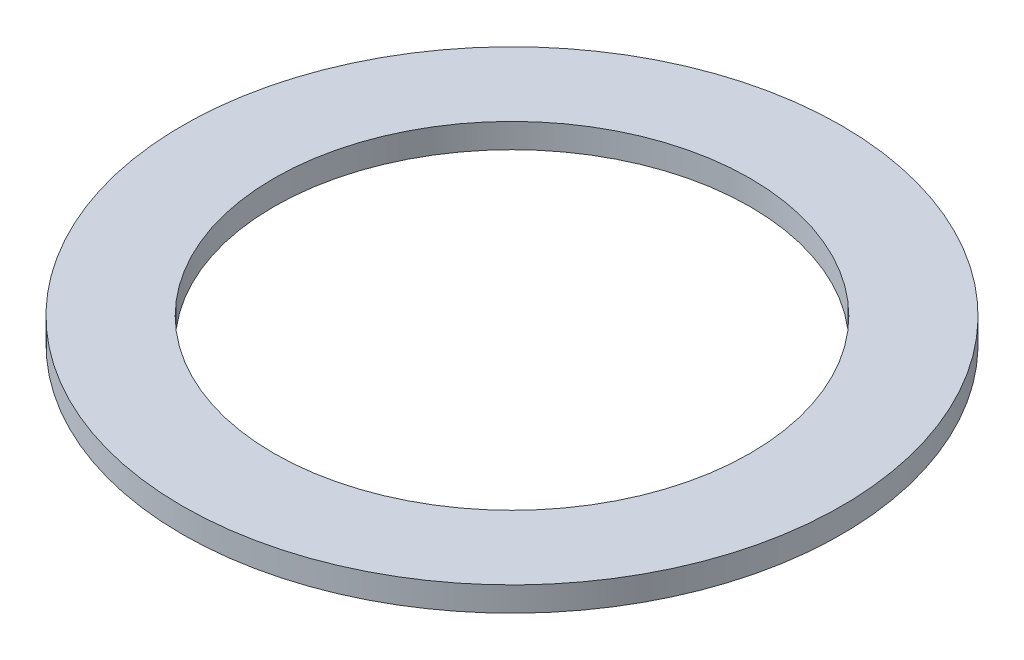
ISO-10303-21;
HEADER;
FILE_DESCRIPTION(('STEP AP214'),'2;1');
FILE_NAME('part.step','',(''),(''),'','','');
FILE_SCHEMA(('AUTOMOTIVE_DESIGN { 1 0 10303 214 1 1 1 1 }'));
ENDSEC;
DATA;
#1=APPLICATION_CONTEXT('core data for automotive mechanical design processes');
#2=APPLICATION_PROTOCOL_DEFINITION('international standard','automotive_design',2000,#1);
#3=PRODUCT_CONTEXT('',#1,'mechanical');
#4=PRODUCT('Part','Part','',(#3));
#5=PRODUCT_RELATED_PRODUCT_CATEGORY('part','',(#4));
#6=PRODUCT_DEFINITION_FORMATION('','',#4);
#7=PRODUCT_DEFINITION_CONTEXT('part definition',#1,'design');
#8=PRODUCT_DEFINITION('design','',#6,#7);
#9=PRODUCT_DEFINITION_SHAPE('','',#8);
#10=(LENGTH_UNIT() NAMED_UNIT(*) SI_UNIT(.MILLI.,.METRE.));
#11=(NAMED_UNIT(*) PLANE_ANGLE_UNIT() SI_UNIT($,.RADIAN.));
#12=(NAMED_UNIT(*) SI_UNIT($,.STERADIAN.) SOLID_ANGLE_UNIT());
#13=UNCERTAINTY_MEASURE_WITH_UNIT(LENGTH_MEASURE(1.E-05),#10,'distance_accuracy_value','');
#14=(GEOMETRIC_REPRESENTATION_CONTEXT(3) GLOBAL_UNCERTAINTY_ASSIGNED_CONTEXT((#13)) GLOBAL_UNIT_ASSIGNED_CONTEXT((#10,
#11,#12)) REPRESENTATION_CONTEXT('',''));
#15=CARTESIAN_POINT('',(0.,0.,0.));
#16=DIRECTION('',(0.,0.,1.));
#17=DIRECTION('',(1.,0.,0.));
#18=AXIS2_PLACEMENT_3D('',#15,#16,#17);
#19=CARTESIAN_POINT('',(0.,0.195231468618644,0.));
#20=DIRECTION('',(0.,-1.,0.));
#21=DIRECTION('',(0.,0.,-1.));
#22=AXIS2_PLACEMENT_3D('',#19,#20,#21);
#23=CYLINDRICAL_SURFACE('',#22,19.4945);
#24=CARTESIAN_POINT('',(0.,0.,0.));
#25=DIRECTION('',(0.,-1.,0.));
#26=DIRECTION('',(0.,0.,-1.));
#27=AXIS2_PLACEMENT_3D('',#24,#25,#26);
#28=CIRCLE('',#27,19.4945);
#29=CARTESIAN_POINT('',(0.,0.,-19.4945));
#30=VERTEX_POINT('',#29);
#31=EDGE_CURVE('E10',#30,#30,#28,.T.);
#32=ORIENTED_EDGE('',*,*,#31,.T.);
#33=EDGE_LOOP('',(#32));
#34=FACE_BOUND('',#33,.T.);
#35=CARTESIAN_POINT('',(0.,2.0066,0.));
#36=DIRECTION('',(0.,-1.,0.));
#37=DIRECTION('',(0.,0.,-1.));
#38=AXIS2_PLACEMENT_3D('',#35,#36,#37);
#39=CIRCLE('',#38,19.4945);
#40=CARTESIAN_POINT('',(0.,2.0066,-19.4945));
#41=VERTEX_POINT('',#40);
#42=EDGE_CURVE('E50',#41,#41,#39,.T.);
#43=ORIENTED_EDGE('',*,*,#42,.F.);
#44=EDGE_LOOP('',(#43));
#45=FACE_BOUND('',#44,.T.);
#46=ADVANCED_FACE('F36',(#34,#45),#23,.F.);
#47=CARTESIAN_POINT('',(19.4945,0.,0.));
#48=DIRECTION('',(0.,-1.,0.));
#49=DIRECTION('',(0.,0.,-1.));
#50=AXIS2_PLACEMENT_3D('',#47,#48,#49);
#51=PLANE('',#50);
#52=CARTESIAN_POINT('',(0.,0.,0.));
#53=DIRECTION('',(0.,-1.,0.));
#54=DIRECTION('',(0.,0.,-1.));
#55=AXIS2_PLACEMENT_3D('',#52,#53,#54);
#56=CIRCLE('',#55,26.9748);
#57=CARTESIAN_POINT('',(0.,0.,-26.9748));
#58=VERTEX_POINT('',#57);
#59=EDGE_CURVE('E42',#58,#58,#56,.T.);
#60=ORIENTED_EDGE('',*,*,#59,.T.);
#61=EDGE_LOOP('',(#60));
#62=FACE_BOUND('',#61,.T.);
#63=ORIENTED_EDGE('',*,*,#31,.F.);
#64=EDGE_LOOP('',(#63));
#65=FACE_BOUND('',#64,.T.);
#66=ADVANCED_FACE('F60',(#62,#65),#51,.T.);
#67=CARTESIAN_POINT('',(0.,0.195231468618644,0.));
#68=DIRECTION('',(0.,-1.,0.));
#69=DIRECTION('',(0.,0.,-1.));
#70=AXIS2_PLACEMENT_3D('',#67,#68,#69);
#71=CYLINDRICAL_SURFACE('',#70,26.9748);
#72=CARTESIAN_POINT('',(0.,2.0066,0.));
#73=DIRECTION('',(0.,-1.,0.));
#74=DIRECTION('',(0.,0.,-1.));
#75=AXIS2_PLACEMENT_3D('',#72,#73,#74);
#76=CIRCLE('',#75,26.9748);
#77=CARTESIAN_POINT('',(0.,2.0066,-26.9748));
#78=VERTEX_POINT('',#77);
#79=EDGE_CURVE('E46',#78,#78,#76,.T.);
#80=ORIENTED_EDGE('',*,*,#79,.T.);
#81=EDGE_LOOP('',(#80));
#82=FACE_BOUND('',#81,.T.);
#83=ORIENTED_EDGE('',*,*,#59,.F.);
#84=EDGE_LOOP('',(#83));
#85=FACE_BOUND('',#84,.T.);
#86=ADVANCED_FACE('F64',(#82,#85),#71,.T.);
#87=CARTESIAN_POINT('',(19.4945,2.0066,0.));
#88=DIRECTION('',(0.,1.,0.));
#89=DIRECTION('',(0.,0.,1.));
#90=AXIS2_PLACEMENT_3D('',#87,#88,#89);
#91=PLANE('',#90);
#92=ORIENTED_EDGE('',*,*,#42,.T.);
#93=EDGE_LOOP('',(#92));
#94=FACE_BOUND('',#93,.T.);
#95=ORIENTED_EDGE('',*,*,#79,.F.);
#96=EDGE_LOOP('',(#95));
#97=FACE_BOUND('',#96,.T.);
#98=ADVANCED_FACE('F56',(#94,#97),#91,.T.);
#99=CLOSED_SHELL('',(#46,#66,#86,#98));
#100=MANIFOLD_SOLID_BREP('B2',#99);
#101=ADVANCED_BREP_SHAPE_REPRESENTATION('',(#18,#100),#14);
#102=SHAPE_DEFINITION_REPRESENTATION(#9,#101);
ENDSEC;
END-ISO-10303-21;
